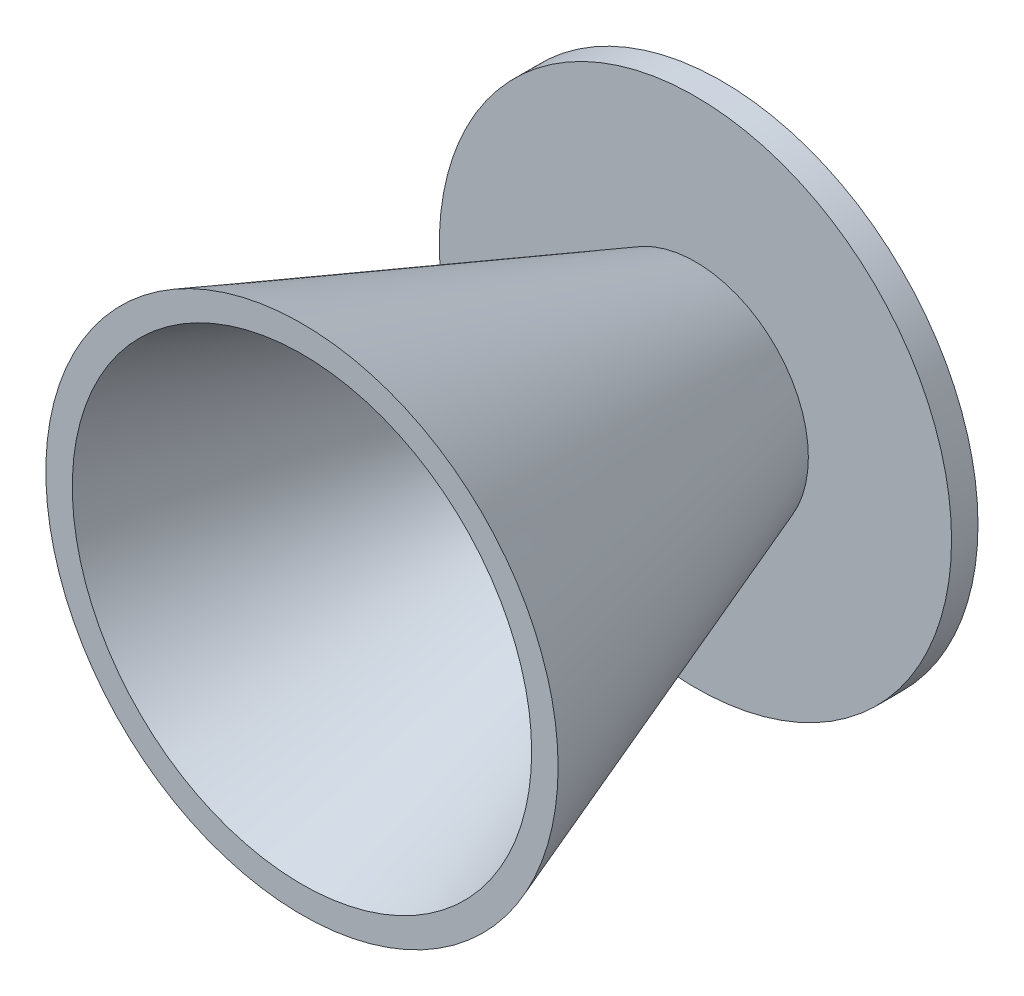
ISO-10303-21;
HEADER;
FILE_DESCRIPTION(('STEP AP214'),'2;1');
FILE_NAME('part.step','',(''),(''),'','','');
FILE_SCHEMA(('AUTOMOTIVE_DESIGN { 1 0 10303 214 1 1 1 1 }'));
ENDSEC;
DATA;
#1=APPLICATION_CONTEXT('core data for automotive mechanical design processes');
#2=APPLICATION_PROTOCOL_DEFINITION('international standard','automotive_design',2000,#1);
#3=PRODUCT_CONTEXT('',#1,'mechanical');
#4=PRODUCT('Part','Part','',(#3));
#5=PRODUCT_RELATED_PRODUCT_CATEGORY('part','',(#4));
#6=PRODUCT_DEFINITION_FORMATION('','',#4);
#7=PRODUCT_DEFINITION_CONTEXT('part definition',#1,'design');
#8=PRODUCT_DEFINITION('design','',#6,#7);
#9=PRODUCT_DEFINITION_SHAPE('','',#8);
#10=(LENGTH_UNIT() NAMED_UNIT(*) SI_UNIT(.MILLI.,.METRE.));
#11=(NAMED_UNIT(*) PLANE_ANGLE_UNIT() SI_UNIT($,.RADIAN.));
#12=(NAMED_UNIT(*) SI_UNIT($,.STERADIAN.) SOLID_ANGLE_UNIT());
#13=UNCERTAINTY_MEASURE_WITH_UNIT(LENGTH_MEASURE(1.E-05),#10,'distance_accuracy_value','');
#14=(GEOMETRIC_REPRESENTATION_CONTEXT(3) GLOBAL_UNCERTAINTY_ASSIGNED_CONTEXT((#13)) GLOBAL_UNIT_ASSIGNED_CONTEXT((#10,
#11,#12)) REPRESENTATION_CONTEXT('',''));
#15=CARTESIAN_POINT('',(0.,0.,0.));
#16=DIRECTION('',(0.,0.,1.));
#17=DIRECTION('',(1.,0.,0.));
#18=AXIS2_PLACEMENT_3D('',#15,#16,#17);
#19=CARTESIAN_POINT('',(0.,10.224874325059,1.6));
#20=DIRECTION('',(0.,0.,1.));
#21=DIRECTION('',(1.,0.,0.));
#22=AXIS2_PLACEMENT_3D('',#19,#20,#21);
#23=PLANE('',#22);
#24=CARTESIAN_POINT('',(0.,0.,1.6));
#25=DIRECTION('',(0.,0.,1.));
#26=DIRECTION('',(1.,0.,0.));
#27=AXIS2_PLACEMENT_3D('',#24,#25,#26);
#28=CIRCLE('',#27,0.981689174306432);
#29=CARTESIAN_POINT('',(0.981689174306432,0.,1.6));
#30=VERTEX_POINT('',#29);
#31=EDGE_CURVE('E38',#30,#30,#28,.T.);
#32=ORIENTED_EDGE('',*,*,#31,.T.);
#33=EDGE_LOOP('',(#32));
#34=FACE_BOUND('',#33,.T.);
#35=ADVANCED_FACE('F31',(#34),#23,.T.);
#36=CARTESIAN_POINT('',(0.,10.224874325059,0.));
#37=DIRECTION('',(0.,0.,1.));
#38=DIRECTION('',(1.,0.,0.));
#39=AXIS2_PLACEMENT_3D('',#36,#37,#38);
#40=PLANE('',#39);
#41=CARTESIAN_POINT('',(0.,0.,0.));
#42=DIRECTION('',(0.,0.,1.));
#43=DIRECTION('',(1.,0.,0.));
#44=AXIS2_PLACEMENT_3D('',#41,#42,#43);
#45=CIRCLE('',#44,15.494);
#46=CARTESIAN_POINT('',(15.494,0.,0.));
#47=VERTEX_POINT('',#46);
#48=EDGE_CURVE('E42',#47,#47,#45,.T.);
#49=ORIENTED_EDGE('',*,*,#48,.F.);
#50=EDGE_LOOP('',(#49));
#51=FACE_BOUND('',#50,.T.);
#52=ADVANCED_FACE('F84',(#51),#40,.F.);
#53=CARTESIAN_POINT('',(0.,0.,1.6));
#54=DIRECTION('',(0.,0.,1.));
#55=DIRECTION('',(1.,0.,0.));
#56=AXIS2_PLACEMENT_3D('',#53,#54,#55);
#57=CYLINDRICAL_SURFACE('',#56,15.494);
#58=CARTESIAN_POINT('',(0.,0.,1.6));
#59=DIRECTION('',(0.,0.,1.));
#60=DIRECTION('',(1.,0.,0.));
#61=AXIS2_PLACEMENT_3D('',#58,#59,#60);
#62=CIRCLE('',#61,15.494);
#63=CARTESIAN_POINT('',(15.494,0.,1.6));
#64=VERTEX_POINT('',#63);
#65=EDGE_CURVE('E46',#64,#64,#62,.T.);
#66=ORIENTED_EDGE('',*,*,#65,.F.);
#67=EDGE_LOOP('',(#66));
#68=FACE_BOUND('',#67,.T.);
#69=ORIENTED_EDGE('',*,*,#48,.T.);
#70=EDGE_LOOP('',(#69));
#71=FACE_BOUND('',#70,.T.);
#72=ADVANCED_FACE('F78',(#68,#71),#57,.T.);
#73=CARTESIAN_POINT('',(0.,10.224874325059,1.6));
#74=DIRECTION('',(0.,0.,-1.));
#75=DIRECTION('',(-1.,0.,0.));
#76=AXIS2_PLACEMENT_3D('',#73,#74,#75);
#77=PLANE('',#76);
#78=CARTESIAN_POINT('',(0.,0.,1.6));
#79=DIRECTION('',(0.,0.,1.));
#80=DIRECTION('',(1.,0.,0.));
#81=AXIS2_PLACEMENT_3D('',#78,#79,#80);
#82=CIRCLE('',#81,6.83150842446427);
#83=CARTESIAN_POINT('',(6.83150842446427,0.,1.6));
#84=VERTEX_POINT('',#83);
#85=EDGE_CURVE('E51',#84,#84,#82,.T.);
#86=ORIENTED_EDGE('',*,*,#85,.F.);
#87=EDGE_LOOP('',(#86));
#88=FACE_BOUND('',#87,.T.);
#89=ORIENTED_EDGE('',*,*,#65,.T.);
#90=EDGE_LOOP('',(#89));
#91=FACE_BOUND('',#90,.T.);
#92=ADVANCED_FACE('F72',(#88,#91),#77,.F.);
#93=CARTESIAN_POINT('',(0.,0.,1.6));
#94=DIRECTION('',(0.,0.,1.));
#95=DIRECTION('',(1.,0.,0.));
#96=AXIS2_PLACEMENT_3D('',#93,#94,#95);
#97=CONICAL_SURFACE('',#96,6.83150842446427,0.34906585039887);
#98=CARTESIAN_POINT('',(0.,0.,25.4));
#99=DIRECTION('',(0.,0.,1.));
#100=DIRECTION('',(1.,0.,0.));
#101=AXIS2_PLACEMENT_3D('',#98,#99,#100);
#102=CIRCLE('',#101,15.494);
#103=CARTESIAN_POINT('',(15.494,0.,25.4));
#104=VERTEX_POINT('',#103);
#105=EDGE_CURVE('E54',#104,#104,#102,.T.);
#106=ORIENTED_EDGE('',*,*,#105,.F.);
#107=EDGE_LOOP('',(#106));
#108=FACE_BOUND('',#107,.T.);
#109=ORIENTED_EDGE('',*,*,#85,.T.);
#110=EDGE_LOOP('',(#109));
#111=FACE_BOUND('',#110,.T.);
#112=ADVANCED_FACE('F66',(#108,#111),#97,.T.);
#113=CARTESIAN_POINT('',(0.,10.2248743250591,25.4));
#114=DIRECTION('',(0.,0.,-1.));
#115=DIRECTION('',(-1.,0.,0.));
#116=AXIS2_PLACEMENT_3D('',#113,#114,#115);
#117=PLANE('',#116);
#118=CARTESIAN_POINT('',(0.,0.,25.4));
#119=DIRECTION('',(0.,0.,1.));
#120=DIRECTION('',(1.,0.,0.));
#121=AXIS2_PLACEMENT_3D('',#118,#119,#120);
#122=CIRCLE('',#121,13.894);
#123=CARTESIAN_POINT('',(13.894,0.,25.4));
#124=VERTEX_POINT('',#123);
#125=EDGE_CURVE('E57',#124,#124,#122,.T.);
#126=ORIENTED_EDGE('',*,*,#125,.F.);
#127=EDGE_LOOP('',(#126));
#128=FACE_BOUND('',#127,.T.);
#129=ORIENTED_EDGE('',*,*,#105,.T.);
#130=EDGE_LOOP('',(#129));
#131=FACE_BOUND('',#130,.T.);
#132=ADVANCED_FACE('F63',(#128,#131),#117,.F.);
#133=CARTESIAN_POINT('',(0.,0.,25.4));
#134=DIRECTION('',(0.,0.,1.));
#135=DIRECTION('',(1.,0.,0.));
#136=AXIS2_PLACEMENT_3D('',#133,#134,#135);
#137=CONICAL_SURFACE('',#136,13.894,0.34906585039887);
#138=CARTESIAN_POINT('',(0.,0.,3.9868192567962));
#139=DIRECTION('',(0.,0.,-1.));
#140=DIRECTION('',(-1.,0.,0.));
#141=AXIS2_PLACEMENT_3D('',#138,#139,#140);
#142=CIRCLE('',#141,6.10023958851148);
#143=CARTESIAN_POINT('',(-6.10023958851148,0.,3.9868192567962));
#144=VERTEX_POINT('',#143);
#145=EDGE_CURVE('E10',#144,#144,#142,.T.);
#146=ORIENTED_EDGE('',*,*,#145,.T.);
#147=EDGE_LOOP('',(#146));
#148=FACE_BOUND('',#147,.T.);
#149=ORIENTED_EDGE('',*,*,#125,.T.);
#150=EDGE_LOOP('',(#149));
#151=FACE_BOUND('',#150,.T.);
#152=ADVANCED_FACE('F61',(#148,#151),#137,.F.);
#153=CARTESIAN_POINT('',(0.,0.,1.6));
#154=DIRECTION('',(0.,0.,1.));
#155=DIRECTION('',(1.,0.,0.));
#156=AXIS2_PLACEMENT_3D('',#153,#154,#155);
#157=CONICAL_SURFACE('',#156,0.981689174306434,1.13446401379632);
#158=ORIENTED_EDGE('',*,*,#145,.F.);
#159=EDGE_LOOP('',(#158));
#160=FACE_BOUND('',#159,.T.);
#161=ORIENTED_EDGE('',*,*,#31,.F.);
#162=EDGE_LOOP('',(#161));
#163=FACE_BOUND('',#162,.T.);
#164=ADVANCED_FACE('F33',(#160,#163),#157,.F.);
#165=CLOSED_SHELL('',(#35,#52,#72,#92,#112,#132,#152,#164));
#166=MANIFOLD_SOLID_BREP('B2',#165);
#167=ADVANCED_BREP_SHAPE_REPRESENTATION('',(#18,#166),#14);
#168=SHAPE_DEFINITION_REPRESENTATION(#9,#167);
ENDSEC;
END-ISO-10303-21;
